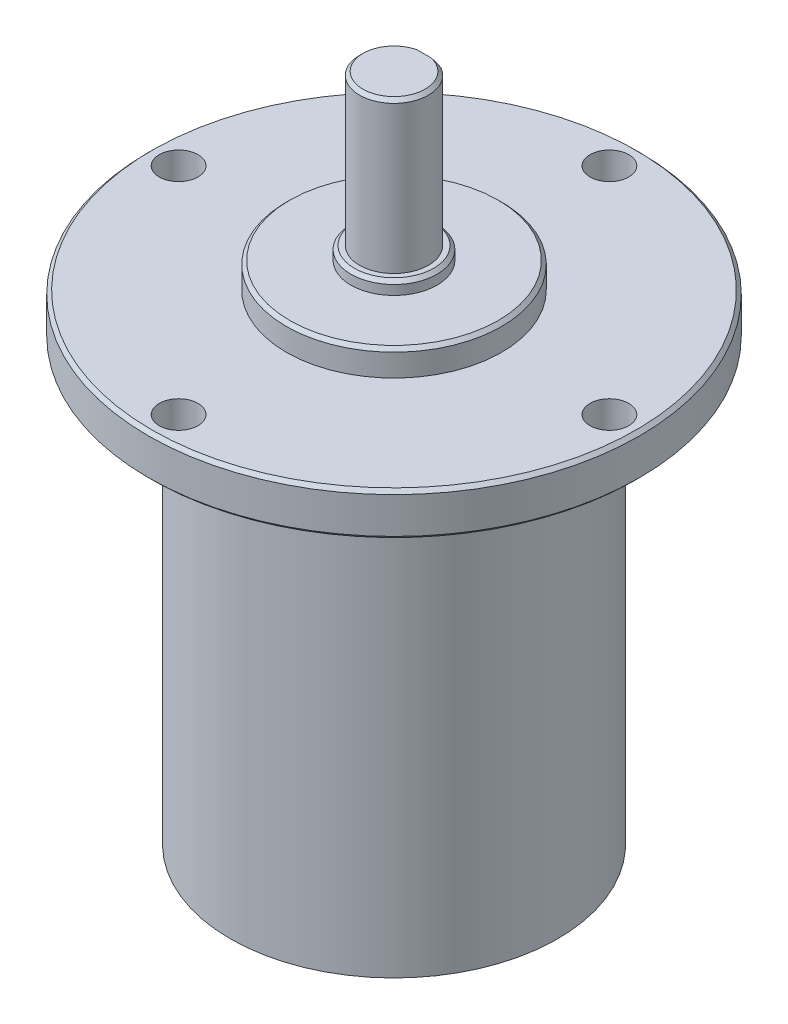
ISO-10303-21;
HEADER;
FILE_DESCRIPTION(('STEP AP214'),'2;1');
FILE_NAME('part.step','',(''),(''),'','','');
FILE_SCHEMA(('AUTOMOTIVE_DESIGN { 1 0 10303 214 1 1 1 1 }'));
ENDSEC;
DATA;
#1=APPLICATION_CONTEXT('core data for automotive mechanical design processes');
#2=APPLICATION_PROTOCOL_DEFINITION('international standard','automotive_design',2000,#1);
#3=PRODUCT_CONTEXT('',#1,'mechanical');
#4=PRODUCT('Part','Part','',(#3));
#5=PRODUCT_RELATED_PRODUCT_CATEGORY('part','',(#4));
#6=PRODUCT_DEFINITION_FORMATION('','',#4);
#7=PRODUCT_DEFINITION_CONTEXT('part definition',#1,'design');
#8=PRODUCT_DEFINITION('design','',#6,#7);
#9=PRODUCT_DEFINITION_SHAPE('','',#8);
#10=(LENGTH_UNIT() NAMED_UNIT(*) SI_UNIT(.MILLI.,.METRE.));
#11=(NAMED_UNIT(*) PLANE_ANGLE_UNIT() SI_UNIT($,.RADIAN.));
#12=(NAMED_UNIT(*) SI_UNIT($,.STERADIAN.) SOLID_ANGLE_UNIT());
#13=UNCERTAINTY_MEASURE_WITH_UNIT(LENGTH_MEASURE(1.E-05),#10,'distance_accuracy_value','');
#14=(GEOMETRIC_REPRESENTATION_CONTEXT(3) GLOBAL_UNCERTAINTY_ASSIGNED_CONTEXT((#13)) GLOBAL_UNIT_ASSIGNED_CONTEXT((#10,
#11,#12)) REPRESENTATION_CONTEXT('',''));
#15=CARTESIAN_POINT('',(0.,0.,0.));
#16=DIRECTION('',(0.,0.,1.));
#17=DIRECTION('',(1.,0.,0.));
#18=AXIS2_PLACEMENT_3D('',#15,#16,#17);
#19=CARTESIAN_POINT('',(0.,0.,0.));
#20=DIRECTION('',(0.,-1.,0.));
#21=DIRECTION('',(0.,0.,-1.));
#22=AXIS2_PLACEMENT_3D('',#19,#20,#21);
#23=PLANE('',#22);
#24=CARTESIAN_POINT('',(0.,0.,0.));
#25=DIRECTION('',(0.,1.,0.));
#26=DIRECTION('',(0.,0.,1.));
#27=AXIS2_PLACEMENT_3D('',#24,#25,#26);
#28=CIRCLE('',#27,19.);
#29=CARTESIAN_POINT('',(0.,0.,19.));
#30=VERTEX_POINT('',#29);
#31=EDGE_CURVE('E114',#30,#30,#28,.T.);
#32=ORIENTED_EDGE('',*,*,#31,.F.);
#33=EDGE_LOOP('',(#32));
#34=FACE_BOUND('',#33,.T.);
#35=ADVANCED_FACE('F41',(#34),#23,.T.);
#36=CARTESIAN_POINT('',(0.,60.2,0.));
#37=DIRECTION('',(0.,1.,0.));
#38=DIRECTION('',(0.,0.,1.));
#39=AXIS2_PLACEMENT_3D('',#36,#37,#38);
#40=CYLINDRICAL_SURFACE('',#39,19.);
#41=ORIENTED_EDGE('',*,*,#31,.T.);
#42=EDGE_LOOP('',(#41));
#43=FACE_BOUND('',#42,.T.);
#44=CARTESIAN_POINT('',(0.,50.7,0.));
#45=DIRECTION('',(0.,1.,0.));
#46=DIRECTION('',(0.,0.,1.));
#47=AXIS2_PLACEMENT_3D('',#44,#45,#46);
#48=CIRCLE('',#47,19.);
#49=CARTESIAN_POINT('',(0.,50.7,19.));
#50=VERTEX_POINT('',#49);
#51=EDGE_CURVE('E110',#50,#50,#48,.T.);
#52=ORIENTED_EDGE('',*,*,#51,.F.);
#53=EDGE_LOOP('',(#52));
#54=FACE_BOUND('',#53,.T.);
#55=ADVANCED_FACE('F198',(#43,#54),#40,.T.);
#56=CARTESIAN_POINT('',(-19.,50.7,0.));
#57=DIRECTION('',(0.,-1.,0.));
#58=DIRECTION('',(0.,0.,-1.));
#59=AXIS2_PLACEMENT_3D('',#56,#57,#58);
#60=PLANE('',#59);
#61=CARTESIAN_POINT('',(0.,50.7,0.));
#62=DIRECTION('',(0.,-1.,0.));
#63=DIRECTION('',(0.,0.,-1.));
#64=AXIS2_PLACEMENT_3D('',#61,#62,#63);
#65=CIRCLE('',#64,28.1);
#66=CARTESIAN_POINT('',(0.,50.7,-28.1));
#67=VERTEX_POINT('',#66);
#68=EDGE_CURVE('E126',#67,#67,#65,.T.);
#69=ORIENTED_EDGE('',*,*,#68,.T.);
#70=EDGE_LOOP('',(#69));
#71=FACE_BOUND('',#70,.T.);
#72=CARTESIAN_POINT('',(-25.,50.7,0.));
#73=DIRECTION('',(0.,-1.,0.));
#74=DIRECTION('',(0.,0.,-1.));
#75=AXIS2_PLACEMENT_3D('',#72,#73,#74);
#76=CIRCLE('',#75,2.25);
#77=CARTESIAN_POINT('',(-25.,50.7,-2.25));
#78=VERTEX_POINT('',#77);
#79=EDGE_CURVE('E91',#78,#78,#76,.T.);
#80=ORIENTED_EDGE('',*,*,#79,.F.);
#81=EDGE_LOOP('',(#80));
#82=FACE_BOUND('',#81,.T.);
#83=CARTESIAN_POINT('',(0.,50.7,-25.));
#84=DIRECTION('',(0.,-1.,0.));
#85=DIRECTION('',(0.,0.,-1.));
#86=AXIS2_PLACEMENT_3D('',#83,#84,#85);
#87=CIRCLE('',#86,2.25);
#88=CARTESIAN_POINT('',(0.,50.7,-27.25));
#89=VERTEX_POINT('',#88);
#90=EDGE_CURVE('E297',#89,#89,#87,.T.);
#91=ORIENTED_EDGE('',*,*,#90,.F.);
#92=EDGE_LOOP('',(#91));
#93=FACE_BOUND('',#92,.T.);
#94=CARTESIAN_POINT('',(25.,50.7,0.));
#95=DIRECTION('',(0.,-1.,0.));
#96=DIRECTION('',(0.,0.,-1.));
#97=AXIS2_PLACEMENT_3D('',#94,#95,#96);
#98=CIRCLE('',#97,2.25);
#99=CARTESIAN_POINT('',(25.,50.7,-2.25));
#100=VERTEX_POINT('',#99);
#101=EDGE_CURVE('E281',#100,#100,#98,.T.);
#102=ORIENTED_EDGE('',*,*,#101,.F.);
#103=EDGE_LOOP('',(#102));
#104=FACE_BOUND('',#103,.T.);
#105=CARTESIAN_POINT('',(0.,50.7,25.));
#106=DIRECTION('',(0.,-1.,0.));
#107=DIRECTION('',(0.,0.,-1.));
#108=AXIS2_PLACEMENT_3D('',#105,#106,#107);
#109=CIRCLE('',#108,2.25);
#110=CARTESIAN_POINT('',(0.,50.7,22.75));
#111=VERTEX_POINT('',#110);
#112=EDGE_CURVE('E276',#111,#111,#109,.T.);
#113=ORIENTED_EDGE('',*,*,#112,.F.);
#114=EDGE_LOOP('',(#113));
#115=FACE_BOUND('',#114,.T.);
#116=ORIENTED_EDGE('',*,*,#51,.T.);
#117=EDGE_LOOP('',(#116));
#118=FACE_BOUND('',#117,.T.);
#119=ADVANCED_FACE('F194',(#71,#82,#93,#104,#115,#118),#60,.T.);
#120=CARTESIAN_POINT('',(0.,60.2,0.));
#121=DIRECTION('',(0.,1.,0.));
#122=DIRECTION('',(0.,0.,1.));
#123=AXIS2_PLACEMENT_3D('',#120,#121,#122);
#124=CYLINDRICAL_SURFACE('',#123,28.5);
#125=CARTESIAN_POINT('',(0.,51.1,0.));
#126=DIRECTION('',(0.,-1.,0.));
#127=DIRECTION('',(0.,0.,-1.));
#128=AXIS2_PLACEMENT_3D('',#125,#126,#127);
#129=CIRCLE('',#128,28.5);
#130=CARTESIAN_POINT('',(0.,51.1,-28.5));
#131=VERTEX_POINT('',#130);
#132=EDGE_CURVE('E122',#131,#131,#129,.F.);
#133=ORIENTED_EDGE('',*,*,#132,.T.);
#134=EDGE_LOOP('',(#133));
#135=FACE_BOUND('',#134,.T.);
#136=CARTESIAN_POINT('',(0.,55.3,0.));
#137=DIRECTION('',(0.,1.,0.));
#138=DIRECTION('',(0.,0.,1.));
#139=AXIS2_PLACEMENT_3D('',#136,#137,#138);
#140=CIRCLE('',#139,28.5);
#141=CARTESIAN_POINT('',(0.,55.3,28.5));
#142=VERTEX_POINT('',#141);
#143=EDGE_CURVE('E118',#142,#142,#140,.F.);
#144=ORIENTED_EDGE('',*,*,#143,.T.);
#145=EDGE_LOOP('',(#144));
#146=FACE_BOUND('',#145,.T.);
#147=ADVANCED_FACE('F190',(#135,#146),#124,.T.);
#148=CARTESIAN_POINT('',(-28.5,55.7,0.));
#149=DIRECTION('',(0.,1.,0.));
#150=DIRECTION('',(0.,0.,1.));
#151=AXIS2_PLACEMENT_3D('',#148,#149,#150);
#152=PLANE('',#151);
#153=CARTESIAN_POINT('',(0.,55.7,0.));
#154=DIRECTION('',(0.,1.,0.));
#155=DIRECTION('',(0.,0.,1.));
#156=AXIS2_PLACEMENT_3D('',#153,#154,#155);
#157=CIRCLE('',#156,28.1);
#158=CARTESIAN_POINT('',(0.,55.7,28.1));
#159=VERTEX_POINT('',#158);
#160=EDGE_CURVE('E130',#159,#159,#157,.T.);
#161=ORIENTED_EDGE('',*,*,#160,.T.);
#162=EDGE_LOOP('',(#161));
#163=FACE_BOUND('',#162,.T.);
#164=CARTESIAN_POINT('',(-25.,55.7,0.));
#165=DIRECTION('',(0.,1.,0.));
#166=DIRECTION('',(0.,0.,1.));
#167=AXIS2_PLACEMENT_3D('',#164,#165,#166);
#168=CIRCLE('',#167,2.25);
#169=CARTESIAN_POINT('',(-25.,55.7,2.25));
#170=VERTEX_POINT('',#169);
#171=EDGE_CURVE('E273',#170,#170,#168,.T.);
#172=ORIENTED_EDGE('',*,*,#171,.F.);
#173=EDGE_LOOP('',(#172));
#174=FACE_BOUND('',#173,.T.);
#175=CARTESIAN_POINT('',(0.,55.7,-25.));
#176=DIRECTION('',(0.,1.,0.));
#177=DIRECTION('',(0.,0.,1.));
#178=AXIS2_PLACEMENT_3D('',#175,#176,#177);
#179=CIRCLE('',#178,2.25);
#180=CARTESIAN_POINT('',(0.,55.7,-22.75));
#181=VERTEX_POINT('',#180);
#182=EDGE_CURVE('E277',#181,#181,#179,.T.);
#183=ORIENTED_EDGE('',*,*,#182,.F.);
#184=EDGE_LOOP('',(#183));
#185=FACE_BOUND('',#184,.T.);
#186=CARTESIAN_POINT('',(25.,55.7,0.));
#187=DIRECTION('',(0.,1.,0.));
#188=DIRECTION('',(0.,0.,1.));
#189=AXIS2_PLACEMENT_3D('',#186,#187,#188);
#190=CIRCLE('',#189,2.25);
#191=CARTESIAN_POINT('',(25.,55.7,2.25));
#192=VERTEX_POINT('',#191);
#193=EDGE_CURVE('E284',#192,#192,#190,.T.);
#194=ORIENTED_EDGE('',*,*,#193,.F.);
#195=EDGE_LOOP('',(#194));
#196=FACE_BOUND('',#195,.T.);
#197=CARTESIAN_POINT('',(0.,55.7,25.));
#198=DIRECTION('',(0.,1.,0.));
#199=DIRECTION('',(0.,0.,1.));
#200=AXIS2_PLACEMENT_3D('',#197,#198,#199);
#201=CIRCLE('',#200,2.25);
#202=CARTESIAN_POINT('',(0.,55.7,27.25));
#203=VERTEX_POINT('',#202);
#204=EDGE_CURVE('E290',#203,#203,#201,.T.);
#205=ORIENTED_EDGE('',*,*,#204,.F.);
#206=EDGE_LOOP('',(#205));
#207=FACE_BOUND('',#206,.T.);
#208=CARTESIAN_POINT('',(0.,55.7,0.));
#209=DIRECTION('',(0.,1.,0.));
#210=DIRECTION('',(0.,0.,1.));
#211=AXIS2_PLACEMENT_3D('',#208,#209,#210);
#212=CIRCLE('',#211,12.5);
#213=CARTESIAN_POINT('',(0.,55.7,12.5));
#214=VERTEX_POINT('',#213);
#215=EDGE_CURVE('E106',#214,#214,#212,.T.);
#216=ORIENTED_EDGE('',*,*,#215,.F.);
#217=EDGE_LOOP('',(#216));
#218=FACE_BOUND('',#217,.T.);
#219=ADVANCED_FACE('F186',(#163,#174,#185,#196,#207,#218),#152,.T.);
#220=CARTESIAN_POINT('',(0.,60.2,0.));
#221=DIRECTION('',(0.,1.,0.));
#222=DIRECTION('',(0.,0.,1.));
#223=AXIS2_PLACEMENT_3D('',#220,#221,#222);
#224=CYLINDRICAL_SURFACE('',#223,12.5);
#225=CARTESIAN_POINT('',(0.,58.3,0.));
#226=DIRECTION('',(0.,1.,0.));
#227=DIRECTION('',(0.,0.,1.));
#228=AXIS2_PLACEMENT_3D('',#225,#226,#227);
#229=CIRCLE('',#228,12.5);
#230=CARTESIAN_POINT('',(0.,58.3,12.5));
#231=VERTEX_POINT('',#230);
#232=EDGE_CURVE('E138',#231,#231,#229,.F.);
#233=ORIENTED_EDGE('',*,*,#232,.T.);
#234=EDGE_LOOP('',(#233));
#235=FACE_BOUND('',#234,.T.);
#236=ORIENTED_EDGE('',*,*,#215,.T.);
#237=EDGE_LOOP('',(#236));
#238=FACE_BOUND('',#237,.T.);
#239=ADVANCED_FACE('F182',(#235,#238),#224,.T.);
#240=CARTESIAN_POINT('',(-12.5,58.7,0.));
#241=DIRECTION('',(0.,1.,0.));
#242=DIRECTION('',(0.,0.,1.));
#243=AXIS2_PLACEMENT_3D('',#240,#241,#242);
#244=PLANE('',#243);
#245=CARTESIAN_POINT('',(0.,58.7,0.));
#246=DIRECTION('',(0.,1.,0.));
#247=DIRECTION('',(0.,0.,1.));
#248=AXIS2_PLACEMENT_3D('',#245,#246,#247);
#249=CIRCLE('',#248,12.1);
#250=CARTESIAN_POINT('',(0.,58.7,12.1));
#251=VERTEX_POINT('',#250);
#252=EDGE_CURVE('E134',#251,#251,#249,.T.);
#253=ORIENTED_EDGE('',*,*,#252,.T.);
#254=EDGE_LOOP('',(#253));
#255=FACE_BOUND('',#254,.T.);
#256=CARTESIAN_POINT('',(0.,58.7,0.));
#257=DIRECTION('',(0.,1.,0.));
#258=DIRECTION('',(0.,0.,1.));
#259=AXIS2_PLACEMENT_3D('',#256,#257,#258);
#260=CIRCLE('',#259,5.);
#261=CARTESIAN_POINT('',(0.,58.7,5.));
#262=VERTEX_POINT('',#261);
#263=EDGE_CURVE('E102',#262,#262,#260,.T.);
#264=ORIENTED_EDGE('',*,*,#263,.F.);
#265=EDGE_LOOP('',(#264));
#266=FACE_BOUND('',#265,.T.);
#267=ADVANCED_FACE('F178',(#255,#266),#244,.T.);
#268=CARTESIAN_POINT('',(0.,60.2,0.));
#269=DIRECTION('',(0.,1.,0.));
#270=DIRECTION('',(0.,0.,1.));
#271=AXIS2_PLACEMENT_3D('',#268,#269,#270);
#272=CYLINDRICAL_SURFACE('',#271,5.);
#273=CARTESIAN_POINT('',(0.,59.8,0.));
#274=DIRECTION('',(0.,1.,0.));
#275=DIRECTION('',(0.,0.,1.));
#276=AXIS2_PLACEMENT_3D('',#273,#274,#275);
#277=CIRCLE('',#276,5.);
#278=CARTESIAN_POINT('',(0.,59.8,5.));
#279=VERTEX_POINT('',#278);
#280=EDGE_CURVE('E11',#279,#279,#277,.F.);
#281=ORIENTED_EDGE('',*,*,#280,.T.);
#282=EDGE_LOOP('',(#281));
#283=FACE_BOUND('',#282,.T.);
#284=ORIENTED_EDGE('',*,*,#263,.T.);
#285=EDGE_LOOP('',(#284));
#286=FACE_BOUND('',#285,.T.);
#287=ADVANCED_FACE('F174',(#283,#286),#272,.T.);
#288=CARTESIAN_POINT('',(-5.,60.2,0.));
#289=DIRECTION('',(0.,1.,0.));
#290=DIRECTION('',(0.,0.,1.));
#291=AXIS2_PLACEMENT_3D('',#288,#289,#290);
#292=PLANE('',#291);
#293=CARTESIAN_POINT('',(0.,60.2,0.));
#294=DIRECTION('',(0.,1.,0.));
#295=DIRECTION('',(0.,0.,1.));
#296=AXIS2_PLACEMENT_3D('',#293,#294,#295);
#297=CIRCLE('',#296,4.60000000000003);
#298=CARTESIAN_POINT('',(0.,60.2,4.60000000000003));
#299=VERTEX_POINT('',#298);
#300=EDGE_CURVE('E51',#299,#299,#297,.T.);
#301=ORIENTED_EDGE('',*,*,#300,.T.);
#302=EDGE_LOOP('',(#301));
#303=FACE_BOUND('',#302,.T.);
#304=CARTESIAN_POINT('',(0.,60.2,0.));
#305=DIRECTION('',(0.,1.,0.));
#306=DIRECTION('',(0.,0.,1.));
#307=AXIS2_PLACEMENT_3D('',#304,#305,#306);
#308=CIRCLE('',#307,4.);
#309=CARTESIAN_POINT('',(-1.93649167310371,60.2,-3.5));
#310=VERTEX_POINT('',#309);
#311=CARTESIAN_POINT('',(1.93649167310371,60.2,-3.5));
#312=VERTEX_POINT('',#311);
#313=EDGE_CURVE('E79',#310,#312,#308,.T.);
#314=ORIENTED_EDGE('',*,*,#313,.F.);
#315=DIRECTION('',(-1.,0.,0.));
#316=VECTOR('',#315,1.);
#317=CARTESIAN_POINT('',(-1.93649167310371,60.2,-3.5));
#318=LINE('',#317,#316);
#319=EDGE_CURVE('E89',#312,#310,#318,.T.);
#320=ORIENTED_EDGE('',*,*,#319,.F.);
#321=EDGE_LOOP('',(#314,#320));
#322=FACE_BOUND('',#321,.T.);
#323=ADVANCED_FACE('F88',(#303,#322),#292,.T.);
#324=CARTESIAN_POINT('',(0.,77.7,0.));
#325=DIRECTION('',(0.,-1.,0.));
#326=DIRECTION('',(0.,0.,-1.));
#327=AXIS2_PLACEMENT_3D('',#324,#325,#326);
#328=CYLINDRICAL_SURFACE('',#327,4.);
#329=DIRECTION('',(0.,-1.,0.));
#330=VECTOR('',#329,1.);
#331=CARTESIAN_POINT('',(1.93649167310371,77.7,-3.5));
#332=LINE('',#331,#330);
#333=CARTESIAN_POINT('',(1.93649167310371,77.3,-3.5));
#334=VERTEX_POINT('',#333);
#335=EDGE_CURVE('E83',#334,#312,#332,.T.);
#336=ORIENTED_EDGE('',*,*,#335,.F.);
#337=CARTESIAN_POINT('',(0.,77.3,0.));
#338=DIRECTION('',(0.,1.,0.));
#339=DIRECTION('',(0.,0.,1.));
#340=AXIS2_PLACEMENT_3D('',#337,#338,#339);
#341=CIRCLE('',#340,4.);
#342=CARTESIAN_POINT('',(-1.93649167310371,77.3,-3.5));
#343=VERTEX_POINT('',#342);
#344=EDGE_CURVE('E65',#334,#343,#341,.F.);
#345=ORIENTED_EDGE('',*,*,#344,.T.);
#346=DIRECTION('',(0.,-1.,0.));
#347=VECTOR('',#346,1.);
#348=CARTESIAN_POINT('',(-1.93649167310371,77.7,-3.5));
#349=LINE('',#348,#347);
#350=EDGE_CURVE('E76',#343,#310,#349,.T.);
#351=ORIENTED_EDGE('',*,*,#350,.T.);
#352=ORIENTED_EDGE('',*,*,#313,.T.);
#353=EDGE_LOOP('',(#336,#345,#351,#352));
#354=FACE_BOUND('',#353,.T.);
#355=ADVANCED_FACE('F78',(#354),#328,.T.);
#356=CARTESIAN_POINT('',(-1.93649167310371,77.7,-3.5));
#357=DIRECTION('',(0.,0.,1.));
#358=DIRECTION('',(1.,0.,0.));
#359=AXIS2_PLACEMENT_3D('',#356,#357,#358);
#360=PLANE('',#359);
#361=DIRECTION('',(-1.,0.,0.));
#362=VECTOR('',#361,1.);
#363=CARTESIAN_POINT('',(-1.93649167310371,77.7,-3.5));
#364=LINE('',#363,#362);
#365=CARTESIAN_POINT('',(0.842614977317779,77.7,-3.5));
#366=VERTEX_POINT('',#365);
#367=CARTESIAN_POINT('',(-0.84261497731778,77.7,-3.5));
#368=VERTEX_POINT('',#367);
#369=EDGE_CURVE('E84',#366,#368,#364,.T.);
#370=ORIENTED_EDGE('',*,*,#369,.F.);
#371=CARTESIAN_POINT('',(0.84261497731778,77.7,-3.5));
#372=CARTESIAN_POINT('',(0.937517002172269,77.6777942155814,-3.5));
#373=CARTESIAN_POINT('',(1.03157611514046,77.6522242047105,-3.5));
#374=CARTESIAN_POINT('',(1.21762379645844,77.5953000159412,-3.5));
#375=CARTESIAN_POINT('',(1.30961778482807,77.5639636376968,-3.5));
#376=CARTESIAN_POINT('',(1.4916794265603,77.4963237629344,-3.5));
#377=CARTESIAN_POINT('',(1.58174808259517,77.4600229284554,-3.5));
#378=CARTESIAN_POINT('',(1.76034011899981,77.3830734582554,-3.5));
#379=CARTESIAN_POINT('',(1.84885796034155,77.34241192293,-3.5));
#380=CARTESIAN_POINT('',(1.93649167310371,77.3,-3.5));
#381=B_SPLINE_CURVE_WITH_KNOTS('',3,(#371,#372,#373,#374,#375,#376,#377,#378,#379,#380),
.UNSPECIFIED.,.F.,.F.,(4,2,2,2,4),(0.,0.292256973394199,0.583626495356439,0.874840387419962,
1.16694082338245),.UNSPECIFIED.);
#382=EDGE_CURVE('E58',#366,#334,#381,.T.);
#383=ORIENTED_EDGE('',*,*,#382,.T.);
#384=ORIENTED_EDGE('',*,*,#335,.T.);
#385=ORIENTED_EDGE('',*,*,#319,.T.);
#386=ORIENTED_EDGE('',*,*,#350,.F.);
#387=CARTESIAN_POINT('',(-1.93649167310371,77.3,-3.5));
#388=CARTESIAN_POINT('',(-1.84885796034155,77.34241192293,-3.5));
#389=CARTESIAN_POINT('',(-1.76034011899981,77.3830734582554,-3.5));
#390=CARTESIAN_POINT('',(-1.58174808259517,77.4600229284554,-3.5));
#391=CARTESIAN_POINT('',(-1.4916794265603,77.4963237629344,-3.5));
#392=CARTESIAN_POINT('',(-1.30961778482807,77.5639636376968,-3.5));
#393=CARTESIAN_POINT('',(-1.21762379645844,77.5953000159412,-3.5));
#394=CARTESIAN_POINT('',(-1.03157611514046,77.6522242047105,-3.5));
#395=CARTESIAN_POINT('',(-0.93751700217227,77.6777942155814,-3.5));
#396=CARTESIAN_POINT('',(-0.84261497731778,77.7,-3.5));
#397=B_SPLINE_CURVE_WITH_KNOTS('',3,(#387,#388,#389,#390,#391,#392,#393,#394,#395,#396),
.UNSPECIFIED.,.F.,.F.,(4,2,2,2,4),(0.,0.292100435962481,0.583314328026008,0.874683849988248,
1.16694082338245),.UNSPECIFIED.);
#398=EDGE_CURVE('E146',#343,#368,#397,.T.);
#399=ORIENTED_EDGE('',*,*,#398,.T.);
#400=EDGE_LOOP('',(#370,#383,#384,#385,#386,#399));
#401=FACE_BOUND('',#400,.T.);
#402=ADVANCED_FACE('F93',(#401),#360,.F.);
#403=CARTESIAN_POINT('',(0.,77.7,0.));
#404=DIRECTION('',(0.,1.,0.));
#405=DIRECTION('',(0.,0.,1.));
#406=AXIS2_PLACEMENT_3D('',#403,#404,#405);
#407=PLANE('',#406);
#408=ORIENTED_EDGE('',*,*,#369,.T.);
#409=CARTESIAN_POINT('',(0.,77.7,0.));
#410=DIRECTION('',(0.,1.,0.));
#411=DIRECTION('',(0.,0.,1.));
#412=AXIS2_PLACEMENT_3D('',#409,#410,#411);
#413=CIRCLE('',#412,3.60000000000003);
#414=EDGE_CURVE('E142',#368,#366,#413,.T.);
#415=ORIENTED_EDGE('',*,*,#414,.T.);
#416=EDGE_LOOP('',(#408,#415));
#417=FACE_BOUND('',#416,.T.);
#418=ADVANCED_FACE('F167',(#417),#407,.T.);
#419=CARTESIAN_POINT('',(0.,0.,25.));
#420=DIRECTION('',(0.,1.,0.));
#421=DIRECTION('',(0.,0.,1.));
#422=AXIS2_PLACEMENT_3D('',#419,#420,#421);
#423=CYLINDRICAL_SURFACE('',#422,2.25);
#424=ORIENTED_EDGE('',*,*,#112,.T.);
#425=EDGE_LOOP('',(#424));
#426=FACE_BOUND('',#425,.T.);
#427=ORIENTED_EDGE('',*,*,#204,.T.);
#428=EDGE_LOOP('',(#427));
#429=FACE_BOUND('',#428,.T.);
#430=ADVANCED_FACE('F246',(#426,#429),#423,.F.);
#431=CARTESIAN_POINT('',(25.,0.,0.));
#432=DIRECTION('',(0.,1.,0.));
#433=DIRECTION('',(0.,0.,1.));
#434=AXIS2_PLACEMENT_3D('',#431,#432,#433);
#435=CYLINDRICAL_SURFACE('',#434,2.25);
#436=ORIENTED_EDGE('',*,*,#101,.T.);
#437=EDGE_LOOP('',(#436));
#438=FACE_BOUND('',#437,.T.);
#439=ORIENTED_EDGE('',*,*,#193,.T.);
#440=EDGE_LOOP('',(#439));
#441=FACE_BOUND('',#440,.T.);
#442=ADVANCED_FACE('F250',(#438,#441),#435,.F.);
#443=CARTESIAN_POINT('',(0.,0.,-25.));
#444=DIRECTION('',(0.,1.,0.));
#445=DIRECTION('',(0.,0.,1.));
#446=AXIS2_PLACEMENT_3D('',#443,#444,#445);
#447=CYLINDRICAL_SURFACE('',#446,2.25);
#448=ORIENTED_EDGE('',*,*,#90,.T.);
#449=EDGE_LOOP('',(#448));
#450=FACE_BOUND('',#449,.T.);
#451=ORIENTED_EDGE('',*,*,#182,.T.);
#452=EDGE_LOOP('',(#451));
#453=FACE_BOUND('',#452,.T.);
#454=ADVANCED_FACE('F255',(#450,#453),#447,.F.);
#455=CARTESIAN_POINT('',(-25.,0.,0.));
#456=DIRECTION('',(0.,1.,0.));
#457=DIRECTION('',(0.,0.,1.));
#458=AXIS2_PLACEMENT_3D('',#455,#456,#457);
#459=CYLINDRICAL_SURFACE('',#458,2.25);
#460=ORIENTED_EDGE('',*,*,#79,.T.);
#461=EDGE_LOOP('',(#460));
#462=FACE_BOUND('',#461,.T.);
#463=ORIENTED_EDGE('',*,*,#171,.T.);
#464=EDGE_LOOP('',(#463));
#465=FACE_BOUND('',#464,.T.);
#466=ADVANCED_FACE('F214',(#462,#465),#459,.F.);
#467=CARTESIAN_POINT('',(0.,51.1,0.));
#468=DIRECTION('',(0.,1.,0.));
#469=DIRECTION('',(0.,0.,1.));
#470=AXIS2_PLACEMENT_3D('',#467,#468,#469);
#471=CONICAL_SURFACE('',#470,28.5,0.785398163397448);
#472=ORIENTED_EDGE('',*,*,#68,.F.);
#473=EDGE_LOOP('',(#472));
#474=FACE_BOUND('',#473,.T.);
#475=ORIENTED_EDGE('',*,*,#132,.F.);
#476=EDGE_LOOP('',(#475));
#477=FACE_BOUND('',#476,.T.);
#478=ADVANCED_FACE('F207',(#474,#477),#471,.T.);
#479=CARTESIAN_POINT('',(0.,55.7,0.));
#480=DIRECTION('',(0.,-1.,0.));
#481=DIRECTION('',(0.,0.,-1.));
#482=AXIS2_PLACEMENT_3D('',#479,#480,#481);
#483=CONICAL_SURFACE('',#482,28.1,0.785398163397435);
#484=ORIENTED_EDGE('',*,*,#143,.F.);
#485=EDGE_LOOP('',(#484));
#486=FACE_BOUND('',#485,.T.);
#487=ORIENTED_EDGE('',*,*,#160,.F.);
#488=EDGE_LOOP('',(#487));
#489=FACE_BOUND('',#488,.T.);
#490=ADVANCED_FACE('F213',(#486,#489),#483,.T.);
#491=CARTESIAN_POINT('',(0.,58.7,0.));
#492=DIRECTION('',(0.,-1.,0.));
#493=DIRECTION('',(0.,0.,-1.));
#494=AXIS2_PLACEMENT_3D('',#491,#492,#493);
#495=CONICAL_SURFACE('',#494,12.1,0.785398163397438);
#496=ORIENTED_EDGE('',*,*,#232,.F.);
#497=EDGE_LOOP('',(#496));
#498=FACE_BOUND('',#497,.T.);
#499=ORIENTED_EDGE('',*,*,#252,.F.);
#500=EDGE_LOOP('',(#499));
#501=FACE_BOUND('',#500,.T.);
#502=ADVANCED_FACE('F220',(#498,#501),#495,.T.);
#503=CARTESIAN_POINT('',(0.,77.7,0.));
#504=DIRECTION('',(0.,-1.,0.));
#505=DIRECTION('',(0.,0.,-1.));
#506=AXIS2_PLACEMENT_3D('',#503,#504,#505);
#507=CONICAL_SURFACE('',#506,3.60000000000003,0.785398163397444);
#508=ORIENTED_EDGE('',*,*,#398,.F.);
#509=ORIENTED_EDGE('',*,*,#344,.F.);
#510=ORIENTED_EDGE('',*,*,#382,.F.);
#511=ORIENTED_EDGE('',*,*,#414,.F.);
#512=EDGE_LOOP('',(#508,#509,#510,#511));
#513=FACE_BOUND('',#512,.T.);
#514=ADVANCED_FACE('F160',(#513),#507,.T.);
#515=CARTESIAN_POINT('',(0.,60.2,0.));
#516=DIRECTION('',(0.,-1.,0.));
#517=DIRECTION('',(0.,0.,-1.));
#518=AXIS2_PLACEMENT_3D('',#515,#516,#517);
#519=CONICAL_SURFACE('',#518,4.60000000000003,0.785398163397443);
#520=ORIENTED_EDGE('',*,*,#280,.F.);
#521=EDGE_LOOP('',(#520));
#522=FACE_BOUND('',#521,.T.);
#523=ORIENTED_EDGE('',*,*,#300,.F.);
#524=EDGE_LOOP('',(#523));
#525=FACE_BOUND('',#524,.T.);
#526=ADVANCED_FACE('F44',(#522,#525),#519,.T.);
#527=CLOSED_SHELL('',(#35,#55,#119,#147,#219,#239,#267,#287,#323,#355,#402,#418,#430,#442,#454,
#466,#478,#490,#502,#514,#526));
#528=MANIFOLD_SOLID_BREP('B2',#527);
#529=ADVANCED_BREP_SHAPE_REPRESENTATION('',(#18,#528),#14);
#530=SHAPE_DEFINITION_REPRESENTATION(#9,#529);
ENDSEC;
END-ISO-10303-21;
